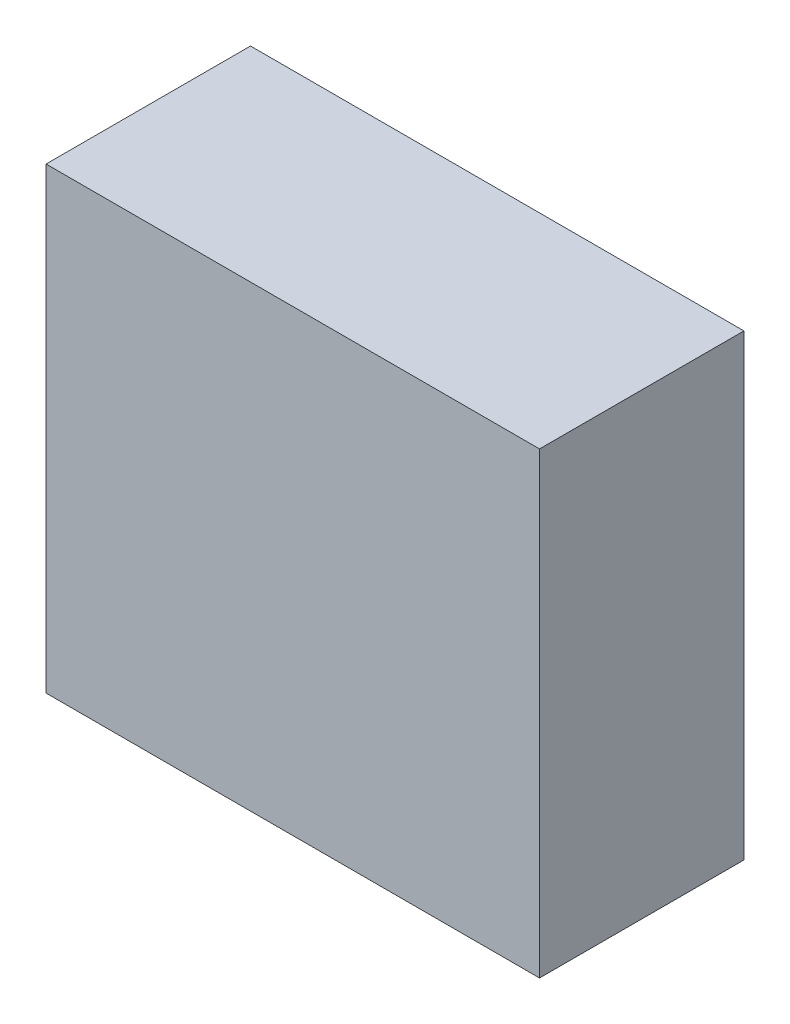
ISO-10303-21;
HEADER;
FILE_DESCRIPTION(('STEP AP214'),'2;1');
FILE_NAME('part.step','',(''),(''),'','','');
FILE_SCHEMA(('AUTOMOTIVE_DESIGN { 1 0 10303 214 1 1 1 1 }'));
ENDSEC;
DATA;
#1=APPLICATION_CONTEXT('core data for automotive mechanical design processes');
#2=APPLICATION_PROTOCOL_DEFINITION('international standard','automotive_design',2000,#1);
#3=PRODUCT_CONTEXT('',#1,'mechanical');
#4=PRODUCT('Part','Part','',(#3));
#5=PRODUCT_RELATED_PRODUCT_CATEGORY('part','',(#4));
#6=PRODUCT_DEFINITION_FORMATION('','',#4);
#7=PRODUCT_DEFINITION_CONTEXT('part definition',#1,'design');
#8=PRODUCT_DEFINITION('design','',#6,#7);
#9=PRODUCT_DEFINITION_SHAPE('','',#8);
#10=(LENGTH_UNIT() NAMED_UNIT(*) SI_UNIT(.MILLI.,.METRE.));
#11=(NAMED_UNIT(*) PLANE_ANGLE_UNIT() SI_UNIT($,.RADIAN.));
#12=(NAMED_UNIT(*) SI_UNIT($,.STERADIAN.) SOLID_ANGLE_UNIT());
#13=UNCERTAINTY_MEASURE_WITH_UNIT(LENGTH_MEASURE(1.E-05),#10,'distance_accuracy_value','');
#14=(GEOMETRIC_REPRESENTATION_CONTEXT(3) GLOBAL_UNCERTAINTY_ASSIGNED_CONTEXT((#13)) GLOBAL_UNIT_ASSIGNED_CONTEXT((#10,
#11,#12)) REPRESENTATION_CONTEXT('',''));
#15=CARTESIAN_POINT('',(0.,0.,0.));
#16=DIRECTION('',(0.,0.,1.));
#17=DIRECTION('',(1.,0.,0.));
#18=AXIS2_PLACEMENT_3D('',#15,#16,#17);
#19=CARTESIAN_POINT('',(-3.556,-3.302,0.051));
#20=DIRECTION('',(0.,-1.,0.));
#21=DIRECTION('',(0.,0.,1.));
#22=AXIS2_PLACEMENT_3D('',#19,#20,#21);
#23=PLANE('',#22);
#24=DIRECTION('',(-1.,0.,0.));
#25=VECTOR('',#24,1.);
#26=CARTESIAN_POINT('',(3.556,-3.302,0.051));
#27=LINE('',#26,#25);
#28=CARTESIAN_POINT('',(3.556,-3.302,0.051));
#29=VERTEX_POINT('',#28);
#30=CARTESIAN_POINT('',(-3.556,-3.302,0.051));
#31=VERTEX_POINT('',#30);
#32=EDGE_CURVE('E11',#29,#31,#27,.T.);
#33=ORIENTED_EDGE('',*,*,#32,.F.);
#34=DIRECTION('',(0.,0.,-1.));
#35=VECTOR('',#34,1.);
#36=CARTESIAN_POINT('',(3.556,-3.302,2.997));
#37=LINE('',#36,#35);
#38=CARTESIAN_POINT('',(3.556,-3.302,2.997));
#39=VERTEX_POINT('',#38);
#40=EDGE_CURVE('E24',#39,#29,#37,.T.);
#41=ORIENTED_EDGE('',*,*,#40,.F.);
#42=DIRECTION('',(1.,0.,0.));
#43=VECTOR('',#42,1.);
#44=CARTESIAN_POINT('',(-3.556,-3.302,2.997));
#45=LINE('',#44,#43);
#46=CARTESIAN_POINT('',(-3.556,-3.302,2.997));
#47=VERTEX_POINT('',#46);
#48=EDGE_CURVE('E88',#47,#39,#45,.T.);
#49=ORIENTED_EDGE('',*,*,#48,.F.);
#50=DIRECTION('',(0.,0.,1.));
#51=VECTOR('',#50,1.);
#52=CARTESIAN_POINT('',(-3.556,-3.302,0.051));
#53=LINE('',#52,#51);
#54=EDGE_CURVE('E77',#31,#47,#53,.T.);
#55=ORIENTED_EDGE('',*,*,#54,.F.);
#56=EDGE_LOOP('',(#33,#41,#49,#55));
#57=FACE_BOUND('',#56,.T.);
#58=ADVANCED_FACE('F17',(#57),#23,.T.);
#59=CARTESIAN_POINT('',(3.556,-3.302,0.051));
#60=DIRECTION('',(1.,0.,0.));
#61=DIRECTION('',(0.,0.,1.));
#62=AXIS2_PLACEMENT_3D('',#59,#60,#61);
#63=PLANE('',#62);
#64=DIRECTION('',(0.,-1.,0.));
#65=VECTOR('',#64,1.);
#66=CARTESIAN_POINT('',(3.556,3.302,0.051));
#67=LINE('',#66,#65);
#68=CARTESIAN_POINT('',(3.556,3.302,0.051));
#69=VERTEX_POINT('',#68);
#70=EDGE_CURVE('E85',#69,#29,#67,.T.);
#71=ORIENTED_EDGE('',*,*,#70,.F.);
#72=DIRECTION('',(0.,0.,-1.));
#73=VECTOR('',#72,1.);
#74=CARTESIAN_POINT('',(3.556,3.302,2.997));
#75=LINE('',#74,#73);
#76=CARTESIAN_POINT('',(3.556,3.302,2.997));
#77=VERTEX_POINT('',#76);
#78=EDGE_CURVE('E83',#77,#69,#75,.T.);
#79=ORIENTED_EDGE('',*,*,#78,.F.);
#80=DIRECTION('',(0.,1.,0.));
#81=VECTOR('',#80,1.);
#82=CARTESIAN_POINT('',(3.556,-3.302,2.997));
#83=LINE('',#82,#81);
#84=EDGE_CURVE('E72',#39,#77,#83,.T.);
#85=ORIENTED_EDGE('',*,*,#84,.F.);
#86=ORIENTED_EDGE('',*,*,#40,.T.);
#87=EDGE_LOOP('',(#71,#79,#85,#86));
#88=FACE_BOUND('',#87,.T.);
#89=ADVANCED_FACE('F90',(#88),#63,.T.);
#90=CARTESIAN_POINT('',(3.556,3.302,0.051));
#91=DIRECTION('',(0.,1.,0.));
#92=DIRECTION('',(0.,0.,1.));
#93=AXIS2_PLACEMENT_3D('',#90,#91,#92);
#94=PLANE('',#93);
#95=DIRECTION('',(1.,0.,0.));
#96=VECTOR('',#95,1.);
#97=CARTESIAN_POINT('',(-3.556,3.302,0.051));
#98=LINE('',#97,#96);
#99=CARTESIAN_POINT('',(-3.556,3.302,0.051));
#100=VERTEX_POINT('',#99);
#101=EDGE_CURVE('E60',#100,#69,#98,.T.);
#102=ORIENTED_EDGE('',*,*,#101,.F.);
#103=DIRECTION('',(0.,0.,-1.));
#104=VECTOR('',#103,1.);
#105=CARTESIAN_POINT('',(-3.556,3.302,2.997));
#106=LINE('',#105,#104);
#107=CARTESIAN_POINT('',(-3.556,3.302,2.997));
#108=VERTEX_POINT('',#107);
#109=EDGE_CURVE('E54',#108,#100,#106,.T.);
#110=ORIENTED_EDGE('',*,*,#109,.F.);
#111=DIRECTION('',(-1.,0.,0.));
#112=VECTOR('',#111,1.);
#113=CARTESIAN_POINT('',(3.556,3.302,2.997));
#114=LINE('',#113,#112);
#115=EDGE_CURVE('E58',#77,#108,#114,.T.);
#116=ORIENTED_EDGE('',*,*,#115,.F.);
#117=ORIENTED_EDGE('',*,*,#78,.T.);
#118=EDGE_LOOP('',(#102,#110,#116,#117));
#119=FACE_BOUND('',#118,.T.);
#120=ADVANCED_FACE('F56',(#119),#94,.T.);
#121=CARTESIAN_POINT('',(-3.556,3.302,0.051));
#122=DIRECTION('',(-1.,0.,0.));
#123=DIRECTION('',(0.,0.,1.));
#124=AXIS2_PLACEMENT_3D('',#121,#122,#123);
#125=PLANE('',#124);
#126=DIRECTION('',(0.,1.,0.));
#127=VECTOR('',#126,1.);
#128=CARTESIAN_POINT('',(-3.556,-3.302,0.051));
#129=LINE('',#128,#127);
#130=EDGE_CURVE('E73',#31,#100,#129,.T.);
#131=ORIENTED_EDGE('',*,*,#130,.F.);
#132=ORIENTED_EDGE('',*,*,#54,.T.);
#133=DIRECTION('',(0.,-1.,0.));
#134=VECTOR('',#133,1.);
#135=CARTESIAN_POINT('',(-3.556,3.302,2.997));
#136=LINE('',#135,#134);
#137=EDGE_CURVE('E70',#108,#47,#136,.T.);
#138=ORIENTED_EDGE('',*,*,#137,.F.);
#139=ORIENTED_EDGE('',*,*,#109,.T.);
#140=EDGE_LOOP('',(#131,#132,#138,#139));
#141=FACE_BOUND('',#140,.T.);
#142=ADVANCED_FACE('F76',(#141),#125,.T.);
#143=CARTESIAN_POINT('',(-3.556,3.302,0.051));
#144=DIRECTION('',(0.,0.,-1.));
#145=DIRECTION('',(0.,1.,0.));
#146=AXIS2_PLACEMENT_3D('',#143,#144,#145);
#147=PLANE('',#146);
#148=ORIENTED_EDGE('',*,*,#101,.T.);
#149=ORIENTED_EDGE('',*,*,#70,.T.);
#150=ORIENTED_EDGE('',*,*,#32,.T.);
#151=ORIENTED_EDGE('',*,*,#130,.T.);
#152=EDGE_LOOP('',(#148,#149,#150,#151));
#153=FACE_BOUND('',#152,.T.);
#154=ADVANCED_FACE('F91',(#153),#147,.T.);
#155=CARTESIAN_POINT('',(-3.556,-3.302,2.997));
#156=DIRECTION('',(0.,0.,1.));
#157=DIRECTION('',(0.,1.,0.));
#158=AXIS2_PLACEMENT_3D('',#155,#156,#157);
#159=PLANE('',#158);
#160=ORIENTED_EDGE('',*,*,#48,.T.);
#161=ORIENTED_EDGE('',*,*,#84,.T.);
#162=ORIENTED_EDGE('',*,*,#115,.T.);
#163=ORIENTED_EDGE('',*,*,#137,.T.);
#164=EDGE_LOOP('',(#160,#161,#162,#163));
#165=FACE_BOUND('',#164,.T.);
#166=ADVANCED_FACE('F69',(#165),#159,.T.);
#167=CLOSED_SHELL('',(#58,#89,#120,#142,#154,#166));
#168=MANIFOLD_SOLID_BREP('B1',#167);
#169=ADVANCED_BREP_SHAPE_REPRESENTATION('',(#18,#168),#14);
#170=SHAPE_DEFINITION_REPRESENTATION(#9,#169);
ENDSEC;
END-ISO-10303-21;
